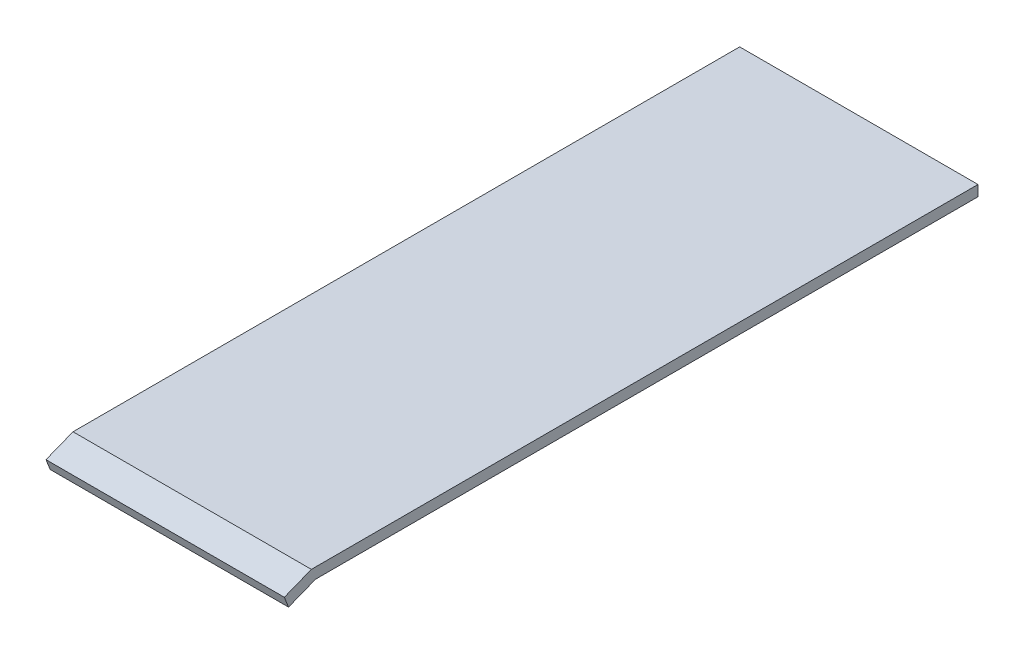
ISO-10303-21;
HEADER;
FILE_DESCRIPTION(('STEP AP214'),'2;1');
FILE_NAME('part.step','',(''),(''),'','','');
FILE_SCHEMA(('AUTOMOTIVE_DESIGN { 1 0 10303 214 1 1 1 1 }'));
ENDSEC;
DATA;
#1=APPLICATION_CONTEXT('core data for automotive mechanical design processes');
#2=APPLICATION_PROTOCOL_DEFINITION('international standard','automotive_design',2000,#1);
#3=PRODUCT_CONTEXT('',#1,'mechanical');
#4=PRODUCT('Part','Part','',(#3));
#5=PRODUCT_RELATED_PRODUCT_CATEGORY('part','',(#4));
#6=PRODUCT_DEFINITION_FORMATION('','',#4);
#7=PRODUCT_DEFINITION_CONTEXT('part definition',#1,'design');
#8=PRODUCT_DEFINITION('design','',#6,#7);
#9=PRODUCT_DEFINITION_SHAPE('','',#8);
#10=(LENGTH_UNIT() NAMED_UNIT(*) SI_UNIT(.MILLI.,.METRE.));
#11=(NAMED_UNIT(*) PLANE_ANGLE_UNIT() SI_UNIT($,.RADIAN.));
#12=(NAMED_UNIT(*) SI_UNIT($,.STERADIAN.) SOLID_ANGLE_UNIT());
#13=UNCERTAINTY_MEASURE_WITH_UNIT(LENGTH_MEASURE(1.E-05),#10,'distance_accuracy_value','');
#14=(GEOMETRIC_REPRESENTATION_CONTEXT(3) GLOBAL_UNCERTAINTY_ASSIGNED_CONTEXT((#13)) GLOBAL_UNIT_ASSIGNED_CONTEXT((#10,
#11,#12)) REPRESENTATION_CONTEXT('',''));
#15=CARTESIAN_POINT('',(0.,0.,0.));
#16=DIRECTION('',(0.,0.,1.));
#17=DIRECTION('',(1.,0.,0.));
#18=AXIS2_PLACEMENT_3D('',#15,#16,#17);
#19=CARTESIAN_POINT('',(3.175,5.08,3.175));
#20=DIRECTION('',(-1.,0.,0.));
#21=DIRECTION('',(0.,0.,1.));
#22=AXIS2_PLACEMENT_3D('',#19,#20,#21);
#23=PLANE('',#22);
#24=DIRECTION('',(0.,0.,-1.));
#25=VECTOR('',#24,1.);
#26=CARTESIAN_POINT('',(3.175,0.,3.175));
#27=LINE('',#26,#25);
#28=CARTESIAN_POINT('',(3.175,0.,3.175));
#29=VERTEX_POINT('',#28);
#30=CARTESIAN_POINT('',(3.175,0.,-3.175));
#31=VERTEX_POINT('',#30);
#32=EDGE_CURVE('E134',#29,#31,#27,.T.);
#33=ORIENTED_EDGE('',*,*,#32,.T.);
#34=DIRECTION('',(0.,-1.,0.));
#35=VECTOR('',#34,1.);
#36=CARTESIAN_POINT('',(3.175,5.08,-3.175));
#37=LINE('',#36,#35);
#38=CARTESIAN_POINT('',(3.175,5.08,-3.175));
#39=VERTEX_POINT('',#38);
#40=EDGE_CURVE('E11',#39,#31,#37,.T.);
#41=ORIENTED_EDGE('',*,*,#40,.F.);
#42=DIRECTION('',(0.,0.,-1.));
#43=VECTOR('',#42,1.);
#44=CARTESIAN_POINT('',(3.175,5.08,3.175));
#45=LINE('',#44,#43);
#46=CARTESIAN_POINT('',(3.175,5.08,3.175));
#47=VERTEX_POINT('',#46);
#48=EDGE_CURVE('E201',#47,#39,#45,.T.);
#49=ORIENTED_EDGE('',*,*,#48,.F.);
#50=DIRECTION('',(0.,-1.,0.));
#51=VECTOR('',#50,1.);
#52=CARTESIAN_POINT('',(3.175,5.08,3.175));
#53=LINE('',#52,#51);
#54=EDGE_CURVE('E56',#47,#29,#53,.T.);
#55=ORIENTED_EDGE('',*,*,#54,.T.);
#56=EDGE_LOOP('',(#33,#41,#49,#55));
#57=FACE_BOUND('',#56,.T.);
#58=ADVANCED_FACE('F39',(#57),#23,.F.);
#59=CARTESIAN_POINT('',(-3.175,5.08,-3.175));
#60=DIRECTION('',(0.,0.,1.));
#61=DIRECTION('',(1.,0.,0.));
#62=AXIS2_PLACEMENT_3D('',#59,#60,#61);
#63=PLANE('',#62);
#64=DIRECTION('',(-1.,0.,0.));
#65=VECTOR('',#64,1.);
#66=CARTESIAN_POINT('',(-3.175,0.,-3.175));
#67=LINE('',#66,#65);
#68=CARTESIAN_POINT('',(-3.175,0.,-3.175));
#69=VERTEX_POINT('',#68);
#70=EDGE_CURVE('E214',#31,#69,#67,.T.);
#71=ORIENTED_EDGE('',*,*,#70,.T.);
#72=DIRECTION('',(0.,-1.,0.));
#73=VECTOR('',#72,1.);
#74=CARTESIAN_POINT('',(-3.175,5.08,-3.175));
#75=LINE('',#74,#73);
#76=CARTESIAN_POINT('',(-3.17499999999999,5.08,-3.175));
#77=VERTEX_POINT('',#76);
#78=EDGE_CURVE('E48',#77,#69,#75,.T.);
#79=ORIENTED_EDGE('',*,*,#78,.F.);
#80=DIRECTION('',(-1.,0.,0.));
#81=VECTOR('',#80,1.);
#82=CARTESIAN_POINT('',(18.025000018,5.08,-3.175));
#83=LINE('',#82,#81);
#84=CARTESIAN_POINT('',(-11.675000018,5.08,-3.175));
#85=VERTEX_POINT('',#84);
#86=EDGE_CURVE('E152',#77,#85,#83,.T.);
#87=ORIENTED_EDGE('',*,*,#86,.T.);
#88=DIRECTION('',(0.,1.,0.));
#89=VECTOR('',#88,1.);
#90=CARTESIAN_POINT('',(-11.675000018,6.40699098430917,-3.175));
#91=LINE('',#90,#89);
#92=CARTESIAN_POINT('',(-11.675000018,6.40699098430917,-3.175));
#93=VERTEX_POINT('',#92);
#94=EDGE_CURVE('E142',#85,#93,#91,.T.);
#95=ORIENTED_EDGE('',*,*,#94,.T.);
#96=DIRECTION('',(-1.,0.,0.));
#97=VECTOR('',#96,1.);
#98=CARTESIAN_POINT('',(18.025000018,6.40699098430917,-3.175));
#99=LINE('',#98,#97);
#100=CARTESIAN_POINT('',(18.025000018,6.40699098430917,-3.175));
#101=VERTEX_POINT('',#100);
#102=EDGE_CURVE('E123',#101,#93,#99,.T.);
#103=ORIENTED_EDGE('',*,*,#102,.F.);
#104=DIRECTION('',(0.,1.,0.));
#105=VECTOR('',#104,1.);
#106=CARTESIAN_POINT('',(18.025000018,6.40699098430917,-3.175));
#107=LINE('',#106,#105);
#108=CARTESIAN_POINT('',(18.025000018,5.08,-3.175));
#109=VERTEX_POINT('',#108);
#110=EDGE_CURVE('E169',#109,#101,#107,.T.);
#111=ORIENTED_EDGE('',*,*,#110,.F.);
#112=EDGE_CURVE('E186',#109,#39,#83,.T.);
#113=ORIENTED_EDGE('',*,*,#112,.T.);
#114=ORIENTED_EDGE('',*,*,#40,.T.);
#115=EDGE_LOOP('',(#71,#79,#87,#95,#103,#111,#113,#114));
#116=FACE_BOUND('',#115,.T.);
#117=ADVANCED_FACE('F149',(#116),#63,.F.);
#118=CARTESIAN_POINT('',(-3.175,5.08,3.175));
#119=DIRECTION('',(1.,0.,0.));
#120=DIRECTION('',(0.,0.,-1.));
#121=AXIS2_PLACEMENT_3D('',#118,#119,#120);
#122=PLANE('',#121);
#123=DIRECTION('',(0.,0.,1.));
#124=VECTOR('',#123,1.);
#125=CARTESIAN_POINT('',(-3.175,0.,3.175));
#126=LINE('',#125,#124);
#127=CARTESIAN_POINT('',(-3.175,0.,3.175));
#128=VERTEX_POINT('',#127);
#129=EDGE_CURVE('E74',#69,#128,#126,.T.);
#130=ORIENTED_EDGE('',*,*,#129,.T.);
#131=DIRECTION('',(0.,-1.,0.));
#132=VECTOR('',#131,1.);
#133=CARTESIAN_POINT('',(-3.175,5.08,3.175));
#134=LINE('',#133,#132);
#135=CARTESIAN_POINT('',(-3.175,5.08,3.175));
#136=VERTEX_POINT('',#135);
#137=EDGE_CURVE('E223',#136,#128,#134,.T.);
#138=ORIENTED_EDGE('',*,*,#137,.F.);
#139=DIRECTION('',(0.,0.,1.));
#140=VECTOR('',#139,1.);
#141=CARTESIAN_POINT('',(-3.175,5.08,3.175));
#142=LINE('',#141,#140);
#143=EDGE_CURVE('E204',#77,#136,#142,.T.);
#144=ORIENTED_EDGE('',*,*,#143,.F.);
#145=ORIENTED_EDGE('',*,*,#78,.T.);
#146=EDGE_LOOP('',(#130,#138,#144,#145));
#147=FACE_BOUND('',#146,.T.);
#148=ADVANCED_FACE('F226',(#147),#122,.F.);
#149=CARTESIAN_POINT('',(-3.175,5.08,3.175));
#150=DIRECTION('',(0.,0.,-1.));
#151=DIRECTION('',(-1.,0.,0.));
#152=AXIS2_PLACEMENT_3D('',#149,#150,#151);
#153=PLANE('',#152);
#154=DIRECTION('',(1.,0.,0.));
#155=VECTOR('',#154,1.);
#156=CARTESIAN_POINT('',(-3.175,0.,3.175));
#157=LINE('',#156,#155);
#158=EDGE_CURVE('E77',#128,#29,#157,.T.);
#159=ORIENTED_EDGE('',*,*,#158,.T.);
#160=ORIENTED_EDGE('',*,*,#54,.F.);
#161=DIRECTION('',(1.,0.,0.));
#162=VECTOR('',#161,1.);
#163=CARTESIAN_POINT('',(-3.175,5.08,3.175));
#164=LINE('',#163,#162);
#165=EDGE_CURVE('E208',#136,#47,#164,.T.);
#166=ORIENTED_EDGE('',*,*,#165,.F.);
#167=ORIENTED_EDGE('',*,*,#137,.T.);
#168=EDGE_LOOP('',(#159,#160,#166,#167));
#169=FACE_BOUND('',#168,.T.);
#170=ADVANCED_FACE('F233',(#169),#153,.F.);
#171=CARTESIAN_POINT('',(0.,0.,0.));
#172=DIRECTION('',(0.,-1.,0.));
#173=DIRECTION('',(0.,0.,-1.));
#174=AXIS2_PLACEMENT_3D('',#171,#172,#173);
#175=PLANE('',#174);
#176=ORIENTED_EDGE('',*,*,#32,.F.);
#177=ORIENTED_EDGE('',*,*,#158,.F.);
#178=ORIENTED_EDGE('',*,*,#129,.F.);
#179=ORIENTED_EDGE('',*,*,#70,.F.);
#180=EDGE_LOOP('',(#176,#177,#178,#179));
#181=FACE_BOUND('',#180,.T.);
#182=ADVANCED_FACE('F229',(#181),#175,.T.);
#183=CARTESIAN_POINT('',(18.025000018,5.08,-3.175));
#184=DIRECTION('',(0.,1.,0.));
#185=DIRECTION('',(0.,0.,1.));
#186=AXIS2_PLACEMENT_3D('',#183,#184,#185);
#187=PLANE('',#186);
#188=ORIENTED_EDGE('',*,*,#165,.T.);
#189=ORIENTED_EDGE('',*,*,#48,.T.);
#190=ORIENTED_EDGE('',*,*,#112,.F.);
#191=DIRECTION('',(0.,0.,-1.));
#192=VECTOR('',#191,1.);
#193=CARTESIAN_POINT('',(18.025000018,5.08,-3.175));
#194=LINE('',#193,#192);
#195=CARTESIAN_POINT('',(18.025000018,5.07999999999999,79.375));
#196=VERTEX_POINT('',#195);
#197=EDGE_CURVE('E183',#196,#109,#194,.T.);
#198=ORIENTED_EDGE('',*,*,#197,.F.);
#199=DIRECTION('',(-1.,0.,0.));
#200=VECTOR('',#199,1.);
#201=CARTESIAN_POINT('',(18.025000018,5.07999999999999,79.375));
#202=LINE('',#201,#200);
#203=CARTESIAN_POINT('',(-11.675000018,5.07999999999999,79.375));
#204=VERTEX_POINT('',#203);
#205=EDGE_CURVE('E190',#196,#204,#202,.T.);
#206=ORIENTED_EDGE('',*,*,#205,.T.);
#207=DIRECTION('',(0.,0.,-1.));
#208=VECTOR('',#207,1.);
#209=CARTESIAN_POINT('',(-11.675000018,5.08,-3.175));
#210=LINE('',#209,#208);
#211=EDGE_CURVE('E166',#204,#85,#210,.T.);
#212=ORIENTED_EDGE('',*,*,#211,.T.);
#213=ORIENTED_EDGE('',*,*,#86,.F.);
#214=ORIENTED_EDGE('',*,*,#143,.T.);
#215=EDGE_LOOP('',(#188,#189,#190,#198,#206,#212,#213,#214));
#216=FACE_BOUND('',#215,.T.);
#217=ADVANCED_FACE('F232',(#216),#187,.F.);
#218=CARTESIAN_POINT('',(18.025000018,6.40699098430915,79.8980996919327));
#219=DIRECTION('',(0.,-1.,0.));
#220=DIRECTION('',(0.,0.,-1.));
#221=AXIS2_PLACEMENT_3D('',#218,#219,#220);
#222=PLANE('',#221);
#223=ORIENTED_EDGE('',*,*,#102,.T.);
#224=DIRECTION('',(0.,0.,1.));
#225=VECTOR('',#224,1.);
#226=CARTESIAN_POINT('',(-11.675000018,6.40699098430915,79.8980996919327));
#227=LINE('',#226,#225);
#228=CARTESIAN_POINT('',(-11.675000018,6.40699098430915,79.8980996919327));
#229=VERTEX_POINT('',#228);
#230=EDGE_CURVE('E127',#93,#229,#227,.T.);
#231=ORIENTED_EDGE('',*,*,#230,.T.);
#232=DIRECTION('',(-1.,0.,0.));
#233=VECTOR('',#232,1.);
#234=CARTESIAN_POINT('',(18.025000018,6.40699098430915,79.8980996919327));
#235=LINE('',#234,#233);
#236=CARTESIAN_POINT('',(18.025000018,6.40699098430915,79.8980996919327));
#237=VERTEX_POINT('',#236);
#238=EDGE_CURVE('E135',#237,#229,#235,.T.);
#239=ORIENTED_EDGE('',*,*,#238,.F.);
#240=DIRECTION('',(0.,0.,1.));
#241=VECTOR('',#240,1.);
#242=CARTESIAN_POINT('',(18.025000018,6.40699098430915,79.8980996919327));
#243=LINE('',#242,#241);
#244=EDGE_CURVE('E128',#101,#237,#243,.T.);
#245=ORIENTED_EDGE('',*,*,#244,.F.);
#246=EDGE_LOOP('',(#223,#231,#239,#245));
#247=FACE_BOUND('',#246,.T.);
#248=ADVANCED_FACE('F125',(#247),#222,.F.);
#249=CARTESIAN_POINT('',(18.025000018,5.07999999999999,83.2643893296341));
#250=DIRECTION('',(0.,-0.9303257268182,-0.366734293488061));
#251=DIRECTION('',(0.,0.366734293488061,-0.9303257268182));
#252=AXIS2_PLACEMENT_3D('',#249,#250,#251);
#253=PLANE('',#252);
#254=ORIENTED_EDGE('',*,*,#238,.T.);
#255=DIRECTION('',(0.,-0.366734293488061,0.9303257268182));
#256=VECTOR('',#255,1.);
#257=CARTESIAN_POINT('',(-11.675000018,5.07999999999999,83.2643893296341));
#258=LINE('',#257,#256);
#259=CARTESIAN_POINT('',(-11.675000018,5.07999999999999,83.2643893296341));
#260=VERTEX_POINT('',#259);
#261=EDGE_CURVE('E146',#229,#260,#258,.T.);
#262=ORIENTED_EDGE('',*,*,#261,.T.);
#263=DIRECTION('',(-1.,0.,0.));
#264=VECTOR('',#263,1.);
#265=CARTESIAN_POINT('',(18.025000018,5.07999999999999,83.2643893296341));
#266=LINE('',#265,#264);
#267=CARTESIAN_POINT('',(18.025000018,5.07999999999999,83.2643893296341));
#268=VERTEX_POINT('',#267);
#269=EDGE_CURVE('E196',#268,#260,#266,.T.);
#270=ORIENTED_EDGE('',*,*,#269,.F.);
#271=DIRECTION('',(0.,-0.366734293488061,0.9303257268182));
#272=VECTOR('',#271,1.);
#273=CARTESIAN_POINT('',(18.025000018,5.07999999999999,83.2643893296341));
#274=LINE('',#273,#272);
#275=EDGE_CURVE('E174',#237,#268,#274,.T.);
#276=ORIENTED_EDGE('',*,*,#275,.F.);
#277=EDGE_LOOP('',(#254,#262,#270,#276));
#278=FACE_BOUND('',#277,.T.);
#279=ADVANCED_FACE('F275',(#278),#253,.F.);
#280=CARTESIAN_POINT('',(18.025000018,3.75300901569083,82.7412896377014));
#281=DIRECTION('',(0.,0.36673429348806,-0.930325726818201));
#282=DIRECTION('',(0.,0.930325726818201,0.36673429348806));
#283=AXIS2_PLACEMENT_3D('',#280,#281,#282);
#284=PLANE('',#283);
#285=ORIENTED_EDGE('',*,*,#269,.T.);
#286=DIRECTION('',(0.,-0.930325726818201,-0.36673429348806));
#287=VECTOR('',#286,1.);
#288=CARTESIAN_POINT('',(-11.675000018,3.75300901569083,82.7412896377014));
#289=LINE('',#288,#287);
#290=CARTESIAN_POINT('',(-11.675000018,3.75300901569083,82.7412896377014));
#291=VERTEX_POINT('',#290);
#292=EDGE_CURVE('E158',#260,#291,#289,.T.);
#293=ORIENTED_EDGE('',*,*,#292,.T.);
#294=DIRECTION('',(-1.,0.,0.));
#295=VECTOR('',#294,1.);
#296=CARTESIAN_POINT('',(18.025000018,3.75300901569083,82.7412896377014));
#297=LINE('',#296,#295);
#298=CARTESIAN_POINT('',(18.025000018,3.75300901569083,82.7412896377014));
#299=VERTEX_POINT('',#298);
#300=EDGE_CURVE('E193',#299,#291,#297,.T.);
#301=ORIENTED_EDGE('',*,*,#300,.F.);
#302=DIRECTION('',(0.,-0.930325726818201,-0.36673429348806));
#303=VECTOR('',#302,1.);
#304=CARTESIAN_POINT('',(18.025000018,3.75300901569083,82.7412896377014));
#305=LINE('',#304,#303);
#306=EDGE_CURVE('E177',#268,#299,#305,.T.);
#307=ORIENTED_EDGE('',*,*,#306,.F.);
#308=EDGE_LOOP('',(#285,#293,#301,#307));
#309=FACE_BOUND('',#308,.T.);
#310=ADVANCED_FACE('F284',(#309),#284,.F.);
#311=CARTESIAN_POINT('',(18.025000018,5.07999999999999,79.375));
#312=DIRECTION('',(0.,0.930325726818201,0.366734293488061));
#313=DIRECTION('',(0.,-0.366734293488061,0.930325726818201));
#314=AXIS2_PLACEMENT_3D('',#311,#312,#313);
#315=PLANE('',#314);
#316=ORIENTED_EDGE('',*,*,#300,.T.);
#317=DIRECTION('',(0.,0.366734293488061,-0.9303257268182));
#318=VECTOR('',#317,1.);
#319=CARTESIAN_POINT('',(-11.675000018,5.07999999999999,79.375));
#320=LINE('',#319,#318);
#321=EDGE_CURVE('E162',#291,#204,#320,.T.);
#322=ORIENTED_EDGE('',*,*,#321,.T.);
#323=ORIENTED_EDGE('',*,*,#205,.F.);
#324=DIRECTION('',(0.,0.366734293488061,-0.9303257268182));
#325=VECTOR('',#324,1.);
#326=CARTESIAN_POINT('',(18.025000018,5.07999999999999,79.375));
#327=LINE('',#326,#325);
#328=EDGE_CURVE('E180',#299,#196,#327,.T.);
#329=ORIENTED_EDGE('',*,*,#328,.F.);
#330=EDGE_LOOP('',(#316,#322,#323,#329));
#331=FACE_BOUND('',#330,.T.);
#332=ADVANCED_FACE('F294',(#331),#315,.F.);
#333=CARTESIAN_POINT('',(18.025000018,0.,0.));
#334=DIRECTION('',(-1.,0.,0.));
#335=DIRECTION('',(0.,0.,1.));
#336=AXIS2_PLACEMENT_3D('',#333,#334,#335);
#337=PLANE('',#336);
#338=ORIENTED_EDGE('',*,*,#110,.T.);
#339=ORIENTED_EDGE('',*,*,#244,.T.);
#340=ORIENTED_EDGE('',*,*,#275,.T.);
#341=ORIENTED_EDGE('',*,*,#306,.T.);
#342=ORIENTED_EDGE('',*,*,#328,.T.);
#343=ORIENTED_EDGE('',*,*,#197,.T.);
#344=EDGE_LOOP('',(#338,#339,#340,#341,#342,#343));
#345=FACE_BOUND('',#344,.T.);
#346=ADVANCED_FACE('F304',(#345),#337,.F.);
#347=CARTESIAN_POINT('',(-11.675000018,0.,0.));
#348=DIRECTION('',(-1.,0.,0.));
#349=DIRECTION('',(0.,0.,1.));
#350=AXIS2_PLACEMENT_3D('',#347,#348,#349);
#351=PLANE('',#350);
#352=ORIENTED_EDGE('',*,*,#94,.F.);
#353=ORIENTED_EDGE('',*,*,#211,.F.);
#354=ORIENTED_EDGE('',*,*,#321,.F.);
#355=ORIENTED_EDGE('',*,*,#292,.F.);
#356=ORIENTED_EDGE('',*,*,#261,.F.);
#357=ORIENTED_EDGE('',*,*,#230,.F.);
#358=EDGE_LOOP('',(#352,#353,#354,#355,#356,#357));
#359=FACE_BOUND('',#358,.T.);
#360=ADVANCED_FACE('F140',(#359),#351,.T.);
#361=CLOSED_SHELL('',(#58,#117,#148,#170,#182,#217,#248,#279,#310,#332,#346,#360));
#362=MANIFOLD_SOLID_BREP('B2',#361);
#363=ADVANCED_BREP_SHAPE_REPRESENTATION('',(#18,#362),#14);
#364=SHAPE_DEFINITION_REPRESENTATION(#9,#363);
ENDSEC;
END-ISO-10303-21;
